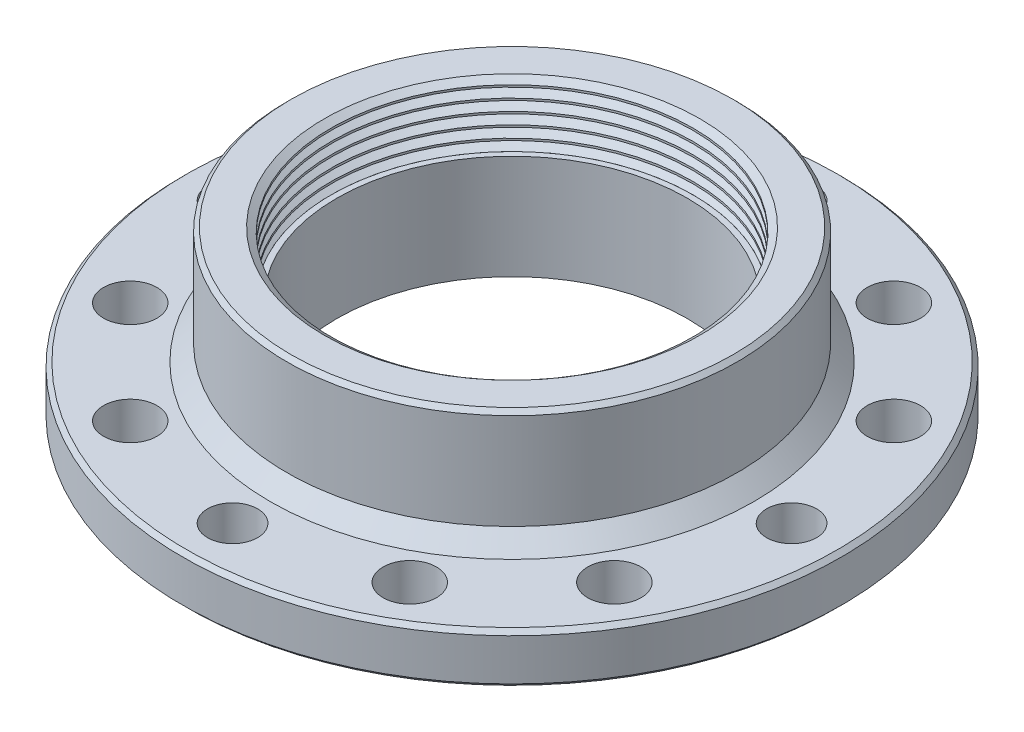
ISO-10303-21;
HEADER;
FILE_DESCRIPTION(('STEP AP214'),'2;1');
FILE_NAME('part.step','',(''),(''),'','','');
FILE_SCHEMA(('AUTOMOTIVE_DESIGN { 1 0 10303 214 1 1 1 1 }'));
ENDSEC;
DATA;
#1=APPLICATION_CONTEXT('core data for automotive mechanical design processes');
#2=APPLICATION_PROTOCOL_DEFINITION('international standard','automotive_design',2000,#1);
#3=PRODUCT_CONTEXT('',#1,'mechanical');
#4=PRODUCT('Part','Part','',(#3));
#5=PRODUCT_RELATED_PRODUCT_CATEGORY('part','',(#4));
#6=PRODUCT_DEFINITION_FORMATION('','',#4);
#7=PRODUCT_DEFINITION_CONTEXT('part definition',#1,'design');
#8=PRODUCT_DEFINITION('design','',#6,#7);
#9=PRODUCT_DEFINITION_SHAPE('','',#8);
#10=(LENGTH_UNIT() NAMED_UNIT(*) SI_UNIT(.MILLI.,.METRE.));
#11=(NAMED_UNIT(*) PLANE_ANGLE_UNIT() SI_UNIT($,.RADIAN.));
#12=(NAMED_UNIT(*) SI_UNIT($,.STERADIAN.) SOLID_ANGLE_UNIT());
#13=UNCERTAINTY_MEASURE_WITH_UNIT(LENGTH_MEASURE(1.E-05),#10,'distance_accuracy_value','');
#14=(GEOMETRIC_REPRESENTATION_CONTEXT(3) GLOBAL_UNCERTAINTY_ASSIGNED_CONTEXT((#13)) GLOBAL_UNIT_ASSIGNED_CONTEXT((#10,
#11,#12)) REPRESENTATION_CONTEXT('',''));
#15=CARTESIAN_POINT('',(0.,0.,0.));
#16=DIRECTION('',(0.,0.,1.));
#17=DIRECTION('',(1.,0.,0.));
#18=AXIS2_PLACEMENT_3D('',#15,#16,#17);
#19=CARTESIAN_POINT('',(0.,12.5,0.));
#20=DIRECTION('',(0.,1.,0.));
#21=DIRECTION('',(0.,0.,1.00000000000001));
#22=AXIS2_PLACEMENT_3D('',#19,#20,#21);
#23=CYLINDRICAL_SURFACE('',#22,21.688);
#24=CARTESIAN_POINT('',(0.,12.5,0.));
#25=DIRECTION('',(0.,1.,0.));
#26=DIRECTION('',(0.,0.,1.00000000000001));
#27=AXIS2_PLACEMENT_3D('',#24,#25,#26);
#28=CIRCLE('',#27,21.688);
#29=CARTESIAN_POINT('',(0.,12.5,21.6880000000001));
#30=VERTEX_POINT('',#29);
#31=EDGE_CURVE('E70',#30,#30,#28,.T.);
#32=ORIENTED_EDGE('',*,*,#31,.F.);
#33=EDGE_LOOP('',(#32));
#34=FACE_BOUND('',#33,.T.);
#35=CARTESIAN_POINT('',(0.,12.5014314789737,0.));
#36=DIRECTION('',(0.,-1.,0.));
#37=DIRECTION('',(0.,0.,-1.00000000000001));
#38=AXIS2_PLACEMENT_3D('',#35,#36,#37);
#39=CIRCLE('',#38,21.688);
#40=CARTESIAN_POINT('',(0.,12.5014314789737,-21.6880000000001));
#41=VERTEX_POINT('',#40);
#42=EDGE_CURVE('E328',#41,#41,#39,.T.);
#43=ORIENTED_EDGE('',*,*,#42,.F.);
#44=EDGE_LOOP('',(#43));
#45=FACE_BOUND('',#44,.T.);
#46=ADVANCED_FACE('F38',(#34,#45),#23,.F.);
#47=CARTESIAN_POINT('',(0.,13.8874314789737,0.));
#48=DIRECTION('',(0.,-1.,0.));
#49=DIRECTION('',(0.,0.,-1.00000000000001));
#50=AXIS2_PLACEMENT_3D('',#47,#48,#49);
#51=CIRCLE('',#50,21.688);
#52=CARTESIAN_POINT('',(0.,13.8874314789737,-21.6880000000001));
#53=VERTEX_POINT('',#52);
#54=EDGE_CURVE('E340',#53,#53,#51,.T.);
#55=ORIENTED_EDGE('',*,*,#54,.F.);
#56=EDGE_LOOP('',(#55));
#57=FACE_BOUND('',#56,.T.);
#58=CARTESIAN_POINT('',(0.,13.6385685210263,0.));
#59=DIRECTION('',(0.,-1.,0.));
#60=DIRECTION('',(0.,0.,-1.00000000000001));
#61=AXIS2_PLACEMENT_3D('',#58,#59,#60);
#62=CIRCLE('',#61,21.688);
#63=CARTESIAN_POINT('',(0.,13.6385685210263,-21.6880000000001));
#64=VERTEX_POINT('',#63);
#65=EDGE_CURVE('E326',#64,#64,#62,.T.);
#66=ORIENTED_EDGE('',*,*,#65,.T.);
#67=EDGE_LOOP('',(#66));
#68=FACE_BOUND('',#67,.T.);
#69=ADVANCED_FACE('F223',(#57,#68),#23,.F.);
#70=CARTESIAN_POINT('',(0.,15.2734314789737,0.));
#71=DIRECTION('',(0.,-1.,0.));
#72=DIRECTION('',(0.,0.,-1.00000000000001));
#73=AXIS2_PLACEMENT_3D('',#70,#71,#72);
#74=CIRCLE('',#73,21.688);
#75=CARTESIAN_POINT('',(0.,15.2734314789737,-21.6880000000001));
#76=VERTEX_POINT('',#75);
#77=EDGE_CURVE('E350',#76,#76,#74,.T.);
#78=ORIENTED_EDGE('',*,*,#77,.F.);
#79=EDGE_LOOP('',(#78));
#80=FACE_BOUND('',#79,.T.);
#81=CARTESIAN_POINT('',(0.,15.0245685210263,0.));
#82=DIRECTION('',(0.,-1.,0.));
#83=DIRECTION('',(0.,0.,-1.00000000000001));
#84=AXIS2_PLACEMENT_3D('',#81,#82,#83);
#85=CIRCLE('',#84,21.688);
#86=CARTESIAN_POINT('',(0.,15.0245685210263,-21.6880000000001));
#87=VERTEX_POINT('',#86);
#88=EDGE_CURVE('E337',#87,#87,#85,.T.);
#89=ORIENTED_EDGE('',*,*,#88,.T.);
#90=EDGE_LOOP('',(#89));
#91=FACE_BOUND('',#90,.T.);
#92=ADVANCED_FACE('F230',(#80,#91),#23,.F.);
#93=CARTESIAN_POINT('',(0.,16.6594314789737,0.));
#94=DIRECTION('',(0.,-1.,0.));
#95=DIRECTION('',(0.,0.,-1.00000000000001));
#96=AXIS2_PLACEMENT_3D('',#93,#94,#95);
#97=CIRCLE('',#96,21.688);
#98=CARTESIAN_POINT('',(0.,16.6594314789737,-21.6880000000001));
#99=VERTEX_POINT('',#98);
#100=EDGE_CURVE('E259',#99,#99,#97,.T.);
#101=ORIENTED_EDGE('',*,*,#100,.F.);
#102=EDGE_LOOP('',(#101));
#103=FACE_BOUND('',#102,.T.);
#104=CARTESIAN_POINT('',(0.,16.4105685210263,0.));
#105=DIRECTION('',(0.,-1.,0.));
#106=DIRECTION('',(0.,0.,-1.00000000000001));
#107=AXIS2_PLACEMENT_3D('',#104,#105,#106);
#108=CIRCLE('',#107,21.688);
#109=CARTESIAN_POINT('',(0.,16.4105685210263,-21.6880000000001));
#110=VERTEX_POINT('',#109);
#111=EDGE_CURVE('E347',#110,#110,#108,.T.);
#112=ORIENTED_EDGE('',*,*,#111,.T.);
#113=EDGE_LOOP('',(#112));
#114=FACE_BOUND('',#113,.T.);
#115=ADVANCED_FACE('F244',(#103,#114),#23,.F.);
#116=CARTESIAN_POINT('',(0.,18.0454314789737,0.));
#117=DIRECTION('',(0.,-1.,0.));
#118=DIRECTION('',(0.,0.,-1.00000000000001));
#119=AXIS2_PLACEMENT_3D('',#116,#117,#118);
#120=CIRCLE('',#119,21.688);
#121=CARTESIAN_POINT('',(0.,18.0454314789737,-21.6880000000001));
#122=VERTEX_POINT('',#121);
#123=EDGE_CURVE('E252',#122,#122,#120,.T.);
#124=ORIENTED_EDGE('',*,*,#123,.F.);
#125=EDGE_LOOP('',(#124));
#126=FACE_BOUND('',#125,.T.);
#127=CARTESIAN_POINT('',(0.,17.7965685210263,0.));
#128=DIRECTION('',(0.,-1.,0.));
#129=DIRECTION('',(0.,0.,-1.00000000000001));
#130=AXIS2_PLACEMENT_3D('',#127,#128,#129);
#131=CIRCLE('',#130,21.688);
#132=CARTESIAN_POINT('',(0.,17.7965685210263,-21.6880000000001));
#133=VERTEX_POINT('',#132);
#134=EDGE_CURVE('E358',#133,#133,#131,.T.);
#135=ORIENTED_EDGE('',*,*,#134,.T.);
#136=EDGE_LOOP('',(#135));
#137=FACE_BOUND('',#136,.T.);
#138=ADVANCED_FACE('F237',(#126,#137),#23,.F.);
#139=CARTESIAN_POINT('',(0.,19.4314314789737,0.));
#140=DIRECTION('',(0.,-1.,0.));
#141=DIRECTION('',(0.,0.,-1.00000000000001));
#142=AXIS2_PLACEMENT_3D('',#139,#140,#141);
#143=CIRCLE('',#142,21.688);
#144=CARTESIAN_POINT('',(0.,19.4314314789737,-21.6880000000001));
#145=VERTEX_POINT('',#144);
#146=EDGE_CURVE('E77',#145,#145,#143,.T.);
#147=ORIENTED_EDGE('',*,*,#146,.F.);
#148=EDGE_LOOP('',(#147));
#149=FACE_BOUND('',#148,.T.);
#150=CARTESIAN_POINT('',(0.,19.1825685210263,0.));
#151=DIRECTION('',(0.,-1.,0.));
#152=DIRECTION('',(0.,0.,-1.00000000000001));
#153=AXIS2_PLACEMENT_3D('',#150,#151,#152);
#154=CIRCLE('',#153,21.688);
#155=CARTESIAN_POINT('',(0.,19.1825685210263,-21.6880000000001));
#156=VERTEX_POINT('',#155);
#157=EDGE_CURVE('E250',#156,#156,#154,.T.);
#158=ORIENTED_EDGE('',*,*,#157,.T.);
#159=EDGE_LOOP('',(#158));
#160=FACE_BOUND('',#159,.T.);
#161=ADVANCED_FACE('F226',(#149,#160),#23,.F.);
#162=CARTESIAN_POINT('',(-25.9763261820386,20.,0.));
#163=DIRECTION('',(0.,-1.,0.));
#164=DIRECTION('',(0.,0.,-1.00000000000001));
#165=AXIS2_PLACEMENT_3D('',#162,#163,#164);
#166=PLANE('',#165);
#167=CARTESIAN_POINT('',(0.,20.,0.));
#168=DIRECTION('',(0.,-1.,0.));
#169=DIRECTION('',(0.,0.,-1.00000000000001));
#170=AXIS2_PLACEMENT_3D('',#167,#168,#169);
#171=CIRCLE('',#170,26.5);
#172=CARTESIAN_POINT('',(0.,20.,-26.5000000000001));
#173=VERTEX_POINT('',#172);
#174=EDGE_CURVE('E10',#173,#173,#171,.F.);
#175=ORIENTED_EDGE('',*,*,#174,.T.);
#176=EDGE_LOOP('',(#175));
#177=FACE_BOUND('',#176,.T.);
#178=CARTESIAN_POINT('',(0.,20.,0.));
#179=DIRECTION('',(0.,-1.,0.));
#180=DIRECTION('',(0.,0.,-1.00000000000001));
#181=AXIS2_PLACEMENT_3D('',#178,#179,#180);
#182=CIRCLE('',#181,22.5);
#183=CARTESIAN_POINT('',(0.,20.,-22.5000000000001));
#184=VERTEX_POINT('',#183);
#185=EDGE_CURVE('E83',#184,#184,#182,.T.);
#186=ORIENTED_EDGE('',*,*,#185,.T.);
#187=EDGE_LOOP('',(#186));
#188=FACE_BOUND('',#187,.T.);
#189=ADVANCED_FACE('F236',(#177,#188),#166,.F.);
#190=CARTESIAN_POINT('',(0.,0.,0.));
#191=DIRECTION('',(0.,-1.,0.));
#192=DIRECTION('',(0.,0.,-1.00000000000001));
#193=AXIS2_PLACEMENT_3D('',#190,#191,#192);
#194=CYLINDRICAL_SURFACE('',#193,21.);
#195=CARTESIAN_POINT('',(0.,0.,0.));
#196=DIRECTION('',(0.,-1.,0.));
#197=DIRECTION('',(0.,0.,-1.00000000000001));
#198=AXIS2_PLACEMENT_3D('',#195,#196,#197);
#199=CIRCLE('',#198,21.);
#200=CARTESIAN_POINT('',(0.,0.,-21.0000000000001));
#201=VERTEX_POINT('',#200);
#202=EDGE_CURVE('E169',#201,#201,#199,.T.);
#203=ORIENTED_EDGE('',*,*,#202,.T.);
#204=EDGE_LOOP('',(#203));
#205=FACE_BOUND('',#204,.T.);
#206=CARTESIAN_POINT('',(0.,12.5,0.));
#207=DIRECTION('',(0.,1.,0.));
#208=DIRECTION('',(0.,0.,1.00000000000001));
#209=AXIS2_PLACEMENT_3D('',#206,#207,#208);
#210=CIRCLE('',#209,21.);
#211=CARTESIAN_POINT('',(0.,12.5,21.0000000000001));
#212=VERTEX_POINT('',#211);
#213=EDGE_CURVE('E42',#212,#212,#210,.F.);
#214=ORIENTED_EDGE('',*,*,#213,.F.);
#215=EDGE_LOOP('',(#214));
#216=FACE_BOUND('',#215,.T.);
#217=ADVANCED_FACE('F218',(#205,#216),#194,.F.);
#218=CARTESIAN_POINT('',(-25.9763261820386,6.,0.));
#219=DIRECTION('',(0.,-1.,0.));
#220=DIRECTION('',(0.,0.,-1.00000000000001));
#221=AXIS2_PLACEMENT_3D('',#218,#219,#220);
#222=PLANE('',#221);
#223=CARTESIAN_POINT('',(0.,6.,0.));
#224=DIRECTION('',(0.,-1.,0.));
#225=DIRECTION('',(0.,0.,-1.00000000000001));
#226=AXIS2_PLACEMENT_3D('',#223,#224,#225);
#227=CIRCLE('',#226,29.);
#228=CARTESIAN_POINT('',(0.,6.,-29.0000000000002));
#229=VERTEX_POINT('',#228);
#230=EDGE_CURVE('E173',#229,#229,#227,.T.);
#231=ORIENTED_EDGE('',*,*,#230,.T.);
#232=EDGE_LOOP('',(#231));
#233=FACE_BOUND('',#232,.T.);
#234=CARTESIAN_POINT('',(0.,6.,0.));
#235=DIRECTION('',(0.,-1.,0.));
#236=DIRECTION('',(0.,0.,-1.00000000000001));
#237=AXIS2_PLACEMENT_3D('',#234,#235,#236);
#238=CIRCLE('',#237,39.);
#239=CARTESIAN_POINT('',(0.,6.,-39.0000000000002));
#240=VERTEX_POINT('',#239);
#241=EDGE_CURVE('E56',#240,#240,#238,.F.);
#242=ORIENTED_EDGE('',*,*,#241,.T.);
#243=EDGE_LOOP('',(#242));
#244=FACE_BOUND('',#243,.T.);
#245=CARTESIAN_POINT('',(16.7500000000001,6.,29.011851026779));
#246=DIRECTION('',(0.,1.,0.));
#247=DIRECTION('',(0.,0.,1.00000000000001));
#248=AXIS2_PLACEMENT_3D('',#245,#246,#247);
#249=CIRCLE('',#248,3.19999999999999);
#250=CARTESIAN_POINT('',(16.7500000000001,6.,32.211851026779));
#251=VERTEX_POINT('',#250);
#252=EDGE_CURVE('E161',#251,#251,#249,.T.);
#253=ORIENTED_EDGE('',*,*,#252,.F.);
#254=EDGE_LOOP('',(#253));
#255=FACE_BOUND('',#254,.T.);
#256=CARTESIAN_POINT('',(29.0118510267789,6.,-16.7500000000001));
#257=DIRECTION('',(0.,1.,0.));
#258=DIRECTION('',(0.,0.,1.00000000000001));
#259=AXIS2_PLACEMENT_3D('',#256,#257,#258);
#260=CIRCLE('',#259,3.19999999999999);
#261=CARTESIAN_POINT('',(29.0118510267789,6.,-13.5500000000001));
#262=VERTEX_POINT('',#261);
#263=EDGE_CURVE('E154',#262,#262,#260,.T.);
#264=ORIENTED_EDGE('',*,*,#263,.F.);
#265=EDGE_LOOP('',(#264));
#266=FACE_BOUND('',#265,.T.);
#267=CARTESIAN_POINT('',(-16.7500000000001,6.,-29.0118510267788));
#268=DIRECTION('',(0.,1.,0.));
#269=DIRECTION('',(0.,0.,1.00000000000001));
#270=AXIS2_PLACEMENT_3D('',#267,#268,#269);
#271=CIRCLE('',#270,3.19999999999999);
#272=CARTESIAN_POINT('',(-16.7500000000001,6.,-25.8118510267788));
#273=VERTEX_POINT('',#272);
#274=EDGE_CURVE('E146',#273,#273,#271,.T.);
#275=ORIENTED_EDGE('',*,*,#274,.F.);
#276=EDGE_LOOP('',(#275));
#277=FACE_BOUND('',#276,.T.);
#278=CARTESIAN_POINT('',(-29.0118510267789,6.,16.7500000000003));
#279=DIRECTION('',(0.,1.,0.));
#280=DIRECTION('',(0.,0.,1.00000000000001));
#281=AXIS2_PLACEMENT_3D('',#278,#279,#280);
#282=CIRCLE('',#281,3.19999999999999);
#283=CARTESIAN_POINT('',(-29.0118510267789,6.,19.9500000000003));
#284=VERTEX_POINT('',#283);
#285=EDGE_CURVE('E139',#284,#284,#282,.T.);
#286=ORIENTED_EDGE('',*,*,#285,.F.);
#287=EDGE_LOOP('',(#286));
#288=FACE_BOUND('',#287,.T.);
#289=CARTESIAN_POINT('',(29.0118510267789,6.,16.7500000000002));
#290=DIRECTION('',(0.,1.,0.));
#291=DIRECTION('',(0.,0.,1.00000000000001));
#292=AXIS2_PLACEMENT_3D('',#289,#290,#291);
#293=CIRCLE('',#292,3.19999999999999);
#294=CARTESIAN_POINT('',(29.0118510267789,6.,19.9500000000002));
#295=VERTEX_POINT('',#294);
#296=EDGE_CURVE('E131',#295,#295,#293,.T.);
#297=ORIENTED_EDGE('',*,*,#296,.F.);
#298=EDGE_LOOP('',(#297));
#299=FACE_BOUND('',#298,.T.);
#300=CARTESIAN_POINT('',(16.7500000000001,6.,-29.0118510267788));
#301=DIRECTION('',(0.,1.,0.));
#302=DIRECTION('',(0.,0.,1.00000000000001));
#303=AXIS2_PLACEMENT_3D('',#300,#301,#302);
#304=CIRCLE('',#303,3.19999999999999);
#305=CARTESIAN_POINT('',(16.7500000000001,6.,-25.8118510267788));
#306=VERTEX_POINT('',#305);
#307=EDGE_CURVE('E124',#306,#306,#304,.T.);
#308=ORIENTED_EDGE('',*,*,#307,.F.);
#309=EDGE_LOOP('',(#308));
#310=FACE_BOUND('',#309,.T.);
#311=CARTESIAN_POINT('',(-29.0118510267789,6.,-16.75));
#312=DIRECTION('',(0.,1.,0.));
#313=DIRECTION('',(0.,0.,1.00000000000001));
#314=AXIS2_PLACEMENT_3D('',#311,#312,#313);
#315=CIRCLE('',#314,3.19999999999999);
#316=CARTESIAN_POINT('',(-29.0118510267789,6.,-13.55));
#317=VERTEX_POINT('',#316);
#318=EDGE_CURVE('E117',#317,#317,#315,.T.);
#319=ORIENTED_EDGE('',*,*,#318,.F.);
#320=EDGE_LOOP('',(#319));
#321=FACE_BOUND('',#320,.T.);
#322=CARTESIAN_POINT('',(-16.7500000000001,6.,29.0118510267789));
#323=DIRECTION('',(0.,1.,0.));
#324=DIRECTION('',(0.,0.,1.00000000000001));
#325=AXIS2_PLACEMENT_3D('',#322,#323,#324);
#326=CIRCLE('',#325,3.19999999999999);
#327=CARTESIAN_POINT('',(-16.7500000000001,6.,32.2118510267789));
#328=VERTEX_POINT('',#327);
#329=EDGE_CURVE('E108',#328,#328,#326,.T.);
#330=ORIENTED_EDGE('',*,*,#329,.F.);
#331=EDGE_LOOP('',(#330));
#332=FACE_BOUND('',#331,.T.);
#333=CARTESIAN_POINT('',(-33.5000000000002,6.,0.));
#334=DIRECTION('',(0.,1.,0.));
#335=DIRECTION('',(0.,0.,1.00000000000001));
#336=AXIS2_PLACEMENT_3D('',#333,#334,#335);
#337=CIRCLE('',#336,3.);
#338=CARTESIAN_POINT('',(-33.5000000000002,6.,3.00000000000002));
#339=VERTEX_POINT('',#338);
#340=EDGE_CURVE('E101',#339,#339,#337,.T.);
#341=ORIENTED_EDGE('',*,*,#340,.F.);
#342=EDGE_LOOP('',(#341));
#343=FACE_BOUND('',#342,.T.);
#344=CARTESIAN_POINT('',(0.,6.,-33.5000000000001));
#345=DIRECTION('',(0.,1.,0.));
#346=DIRECTION('',(0.,0.,1.00000000000001));
#347=AXIS2_PLACEMENT_3D('',#344,#345,#346);
#348=CIRCLE('',#347,3.);
#349=CARTESIAN_POINT('',(0.,6.,-30.5000000000001));
#350=VERTEX_POINT('',#349);
#351=EDGE_CURVE('E94',#350,#350,#348,.T.);
#352=ORIENTED_EDGE('',*,*,#351,.F.);
#353=EDGE_LOOP('',(#352));
#354=FACE_BOUND('',#353,.T.);
#355=CARTESIAN_POINT('',(33.5000000000002,6.,0.));
#356=DIRECTION('',(0.,1.,0.));
#357=DIRECTION('',(0.,0.,1.00000000000001));
#358=AXIS2_PLACEMENT_3D('',#355,#356,#357);
#359=CIRCLE('',#358,3.);
#360=CARTESIAN_POINT('',(33.5000000000002,6.,3.00000000000003));
#361=VERTEX_POINT('',#360);
#362=EDGE_CURVE('E89',#361,#361,#359,.T.);
#363=ORIENTED_EDGE('',*,*,#362,.F.);
#364=EDGE_LOOP('',(#363));
#365=FACE_BOUND('',#364,.T.);
#366=CARTESIAN_POINT('',(0.,6.,33.5000000000003));
#367=DIRECTION('',(0.,1.,0.));
#368=DIRECTION('',(0.,0.,1.00000000000001));
#369=AXIS2_PLACEMENT_3D('',#366,#367,#368);
#370=CIRCLE('',#369,3.);
#371=CARTESIAN_POINT('',(0.,6.,36.5000000000003));
#372=VERTEX_POINT('',#371);
#373=EDGE_CURVE('E61',#372,#372,#370,.T.);
#374=ORIENTED_EDGE('',*,*,#373,.F.);
#375=EDGE_LOOP('',(#374));
#376=FACE_BOUND('',#375,.T.);
#377=CARTESIAN_POINT('',(-23.6880771697496,6.,-23.6880771697494));
#378=DIRECTION('',(0.,-1.,0.));
#379=DIRECTION('',(0.,0.,-1.00000000000001));
#380=AXIS2_PLACEMENT_3D('',#377,#378,#379);
#381=CIRCLE('',#380,0.500000000000001);
#382=CARTESIAN_POINT('',(-23.6880771697496,6.,-24.1880771697494));
#383=VERTEX_POINT('',#382);
#384=EDGE_CURVE('E59',#383,#383,#381,.F.);
#385=ORIENTED_EDGE('',*,*,#384,.F.);
#386=EDGE_LOOP('',(#385));
#387=FACE_BOUND('',#386,.T.);
#388=ADVANCED_FACE('F197',(#233,#244,#255,#266,#277,#288,#299,#310,#321,#332,#343,#354,#365,
#376,#387),#222,.F.);
#389=CARTESIAN_POINT('',(0.,0.,0.));
#390=DIRECTION('',(0.,-1.,0.));
#391=DIRECTION('',(0.,0.,-1.00000000000001));
#392=AXIS2_PLACEMENT_3D('',#389,#390,#391);
#393=CYLINDRICAL_SURFACE('',#392,39.5);
#394=CARTESIAN_POINT('',(0.,0.49999999999998,0.));
#395=DIRECTION('',(0.,-1.,0.));
#396=DIRECTION('',(0.,0.,-1.00000000000001));
#397=AXIS2_PLACEMENT_3D('',#394,#395,#396);
#398=CIRCLE('',#397,39.5);
#399=CARTESIAN_POINT('',(0.,0.49999999999998,-39.5000000000002));
#400=VERTEX_POINT('',#399);
#401=EDGE_CURVE('E189',#400,#400,#398,.F.);
#402=ORIENTED_EDGE('',*,*,#401,.T.);
#403=EDGE_LOOP('',(#402));
#404=FACE_BOUND('',#403,.T.);
#405=CARTESIAN_POINT('',(0.,5.49999999999998,0.));
#406=DIRECTION('',(0.,-1.,0.));
#407=DIRECTION('',(0.,0.,-1.00000000000001));
#408=AXIS2_PLACEMENT_3D('',#405,#406,#407);
#409=CIRCLE('',#408,39.5);
#410=CARTESIAN_POINT('',(0.,5.49999999999998,-39.5000000000002));
#411=VERTEX_POINT('',#410);
#412=EDGE_CURVE('E185',#411,#411,#409,.T.);
#413=ORIENTED_EDGE('',*,*,#412,.T.);
#414=EDGE_LOOP('',(#413));
#415=FACE_BOUND('',#414,.T.);
#416=ADVANCED_FACE('F206',(#404,#415),#393,.T.);
#417=CARTESIAN_POINT('',(-25.9763261820386,0.,0.));
#418=DIRECTION('',(0.,-1.,0.));
#419=DIRECTION('',(0.,0.,-1.00000000000001));
#420=AXIS2_PLACEMENT_3D('',#417,#418,#419);
#421=PLANE('',#420);
#422=CARTESIAN_POINT('',(0.,0.,33.5000000000003));
#423=DIRECTION('',(0.,1.,0.));
#424=DIRECTION('',(0.,0.,1.00000000000001));
#425=AXIS2_PLACEMENT_3D('',#422,#423,#424);
#426=CIRCLE('',#425,3.);
#427=CARTESIAN_POINT('',(0.,0.,36.5000000000003));
#428=VERTEX_POINT('',#427);
#429=EDGE_CURVE('E66',#428,#428,#426,.T.);
#430=ORIENTED_EDGE('',*,*,#429,.T.);
#431=EDGE_LOOP('',(#430));
#432=FACE_BOUND('',#431,.T.);
#433=CARTESIAN_POINT('',(33.5000000000002,0.,0.));
#434=DIRECTION('',(0.,1.,0.));
#435=DIRECTION('',(0.,0.,1.00000000000001));
#436=AXIS2_PLACEMENT_3D('',#433,#434,#435);
#437=CIRCLE('',#436,3.);
#438=CARTESIAN_POINT('',(33.5000000000002,0.,3.00000000000003));
#439=VERTEX_POINT('',#438);
#440=EDGE_CURVE('E91',#439,#439,#437,.T.);
#441=ORIENTED_EDGE('',*,*,#440,.T.);
#442=EDGE_LOOP('',(#441));
#443=FACE_BOUND('',#442,.T.);
#444=CARTESIAN_POINT('',(0.,0.,-33.5000000000001));
#445=DIRECTION('',(0.,1.,0.));
#446=DIRECTION('',(0.,0.,1.00000000000001));
#447=AXIS2_PLACEMENT_3D('',#444,#445,#446);
#448=CIRCLE('',#447,3.);
#449=CARTESIAN_POINT('',(0.,0.,-30.5000000000001));
#450=VERTEX_POINT('',#449);
#451=EDGE_CURVE('E98',#450,#450,#448,.T.);
#452=ORIENTED_EDGE('',*,*,#451,.T.);
#453=EDGE_LOOP('',(#452));
#454=FACE_BOUND('',#453,.T.);
#455=CARTESIAN_POINT('',(-33.5000000000002,0.,0.));
#456=DIRECTION('',(0.,1.,0.));
#457=DIRECTION('',(0.,0.,1.00000000000001));
#458=AXIS2_PLACEMENT_3D('',#455,#456,#457);
#459=CIRCLE('',#458,3.);
#460=CARTESIAN_POINT('',(-33.5000000000002,0.,3.00000000000002));
#461=VERTEX_POINT('',#460);
#462=EDGE_CURVE('E105',#461,#461,#459,.T.);
#463=ORIENTED_EDGE('',*,*,#462,.T.);
#464=EDGE_LOOP('',(#463));
#465=FACE_BOUND('',#464,.T.);
#466=CARTESIAN_POINT('',(-16.7500000000001,0.,29.0118510267789));
#467=DIRECTION('',(0.,1.,0.));
#468=DIRECTION('',(0.,0.,1.00000000000001));
#469=AXIS2_PLACEMENT_3D('',#466,#467,#468);
#470=CIRCLE('',#469,3.2);
#471=CARTESIAN_POINT('',(-16.7500000000001,0.,32.2118510267789));
#472=VERTEX_POINT('',#471);
#473=EDGE_CURVE('E114',#472,#472,#470,.T.);
#474=ORIENTED_EDGE('',*,*,#473,.T.);
#475=EDGE_LOOP('',(#474));
#476=FACE_BOUND('',#475,.T.);
#477=CARTESIAN_POINT('',(-29.0118510267789,0.,-16.75));
#478=DIRECTION('',(0.,1.,0.));
#479=DIRECTION('',(0.,0.,1.00000000000001));
#480=AXIS2_PLACEMENT_3D('',#477,#478,#479);
#481=CIRCLE('',#480,3.2);
#482=CARTESIAN_POINT('',(-29.0118510267789,0.,-13.55));
#483=VERTEX_POINT('',#482);
#484=EDGE_CURVE('E121',#483,#483,#481,.T.);
#485=ORIENTED_EDGE('',*,*,#484,.T.);
#486=EDGE_LOOP('',(#485));
#487=FACE_BOUND('',#486,.T.);
#488=CARTESIAN_POINT('',(16.7500000000001,0.,-29.0118510267788));
#489=DIRECTION('',(0.,1.,0.));
#490=DIRECTION('',(0.,0.,1.00000000000001));
#491=AXIS2_PLACEMENT_3D('',#488,#489,#490);
#492=CIRCLE('',#491,3.2);
#493=CARTESIAN_POINT('',(16.7500000000001,0.,-25.8118510267788));
#494=VERTEX_POINT('',#493);
#495=EDGE_CURVE('E128',#494,#494,#492,.T.);
#496=ORIENTED_EDGE('',*,*,#495,.T.);
#497=EDGE_LOOP('',(#496));
#498=FACE_BOUND('',#497,.T.);
#499=CARTESIAN_POINT('',(29.0118510267789,0.,16.7500000000002));
#500=DIRECTION('',(0.,1.,0.));
#501=DIRECTION('',(0.,0.,1.00000000000001));
#502=AXIS2_PLACEMENT_3D('',#499,#500,#501);
#503=CIRCLE('',#502,3.2);
#504=CARTESIAN_POINT('',(29.0118510267789,0.,19.9500000000002));
#505=VERTEX_POINT('',#504);
#506=EDGE_CURVE('E135',#505,#505,#503,.T.);
#507=ORIENTED_EDGE('',*,*,#506,.T.);
#508=EDGE_LOOP('',(#507));
#509=FACE_BOUND('',#508,.T.);
#510=CARTESIAN_POINT('',(-29.0118510267789,0.,16.7500000000003));
#511=DIRECTION('',(0.,1.,0.));
#512=DIRECTION('',(0.,0.,1.00000000000001));
#513=AXIS2_PLACEMENT_3D('',#510,#511,#512);
#514=CIRCLE('',#513,3.2);
#515=CARTESIAN_POINT('',(-29.0118510267789,0.,19.9500000000003));
#516=VERTEX_POINT('',#515);
#517=EDGE_CURVE('E142',#516,#516,#514,.T.);
#518=ORIENTED_EDGE('',*,*,#517,.T.);
#519=EDGE_LOOP('',(#518));
#520=FACE_BOUND('',#519,.T.);
#521=CARTESIAN_POINT('',(-16.7500000000001,0.,-29.0118510267788));
#522=DIRECTION('',(0.,1.,0.));
#523=DIRECTION('',(0.,0.,1.00000000000001));
#524=AXIS2_PLACEMENT_3D('',#521,#522,#523);
#525=CIRCLE('',#524,3.2);
#526=CARTESIAN_POINT('',(-16.7500000000001,0.,-25.8118510267788));
#527=VERTEX_POINT('',#526);
#528=EDGE_CURVE('E150',#527,#527,#525,.T.);
#529=ORIENTED_EDGE('',*,*,#528,.T.);
#530=EDGE_LOOP('',(#529));
#531=FACE_BOUND('',#530,.T.);
#532=CARTESIAN_POINT('',(29.0118510267789,0.,-16.7500000000001));
#533=DIRECTION('',(0.,1.,0.));
#534=DIRECTION('',(0.,0.,1.00000000000001));
#535=AXIS2_PLACEMENT_3D('',#532,#533,#534);
#536=CIRCLE('',#535,3.2);
#537=CARTESIAN_POINT('',(29.0118510267789,0.,-13.5500000000001));
#538=VERTEX_POINT('',#537);
#539=EDGE_CURVE('E158',#538,#538,#536,.T.);
#540=ORIENTED_EDGE('',*,*,#539,.T.);
#541=EDGE_LOOP('',(#540));
#542=FACE_BOUND('',#541,.T.);
#543=CARTESIAN_POINT('',(16.7500000000001,0.,29.011851026779));
#544=DIRECTION('',(0.,1.,0.));
#545=DIRECTION('',(0.,0.,1.00000000000001));
#546=AXIS2_PLACEMENT_3D('',#543,#544,#545);
#547=CIRCLE('',#546,3.2);
#548=CARTESIAN_POINT('',(16.7500000000001,0.,32.211851026779));
#549=VERTEX_POINT('',#548);
#550=EDGE_CURVE('E165',#549,#549,#547,.T.);
#551=ORIENTED_EDGE('',*,*,#550,.T.);
#552=EDGE_LOOP('',(#551));
#553=FACE_BOUND('',#552,.T.);
#554=CARTESIAN_POINT('',(0.,0.,0.));
#555=DIRECTION('',(0.,-1.,0.));
#556=DIRECTION('',(0.,0.,-1.00000000000001));
#557=AXIS2_PLACEMENT_3D('',#554,#555,#556);
#558=CIRCLE('',#557,39.);
#559=CARTESIAN_POINT('',(0.,0.,-39.0000000000003));
#560=VERTEX_POINT('',#559);
#561=EDGE_CURVE('E181',#560,#560,#558,.T.);
#562=ORIENTED_EDGE('',*,*,#561,.T.);
#563=EDGE_LOOP('',(#562));
#564=FACE_BOUND('',#563,.T.);
#565=ORIENTED_EDGE('',*,*,#202,.F.);
#566=EDGE_LOOP('',(#565));
#567=FACE_BOUND('',#566,.T.);
#568=ADVANCED_FACE('F208',(#432,#443,#454,#465,#476,#487,#498,#509,#520,#531,#542,#553,#564,
#567),#421,.T.);
#569=CARTESIAN_POINT('',(0.,0.,0.));
#570=DIRECTION('',(0.,-1.,0.));
#571=DIRECTION('',(0.,0.,-1.00000000000001));
#572=AXIS2_PLACEMENT_3D('',#569,#570,#571);
#573=CYLINDRICAL_SURFACE('',#572,27.);
#574=CARTESIAN_POINT('',(0.,19.5,0.));
#575=DIRECTION('',(0.,-1.,0.));
#576=DIRECTION('',(0.,0.,-1.00000000000001));
#577=AXIS2_PLACEMENT_3D('',#574,#575,#576);
#578=CIRCLE('',#577,27.);
#579=CARTESIAN_POINT('',(0.,19.5,-27.0000000000002));
#580=VERTEX_POINT('',#579);
#581=EDGE_CURVE('E47',#580,#580,#578,.T.);
#582=ORIENTED_EDGE('',*,*,#581,.T.);
#583=EDGE_LOOP('',(#582));
#584=FACE_BOUND('',#583,.T.);
#585=CARTESIAN_POINT('',(0.,7.99999999999999,0.));
#586=DIRECTION('',(0.,-1.,0.));
#587=DIRECTION('',(0.,0.,-1.00000000000001));
#588=AXIS2_PLACEMENT_3D('',#585,#586,#587);
#589=CIRCLE('',#588,27.);
#590=CARTESIAN_POINT('',(0.,7.99999999999999,-27.0000000000002));
#591=VERTEX_POINT('',#590);
#592=EDGE_CURVE('E177',#591,#591,#589,.F.);
#593=ORIENTED_EDGE('',*,*,#592,.T.);
#594=EDGE_LOOP('',(#593));
#595=FACE_BOUND('',#594,.T.);
#596=ADVANCED_FACE('F215',(#584,#595),#573,.T.);
#597=CARTESIAN_POINT('',(0.,6.,0.));
#598=DIRECTION('',(0.,-1.,0.));
#599=DIRECTION('',(0.,0.,-1.00000000000001));
#600=AXIS2_PLACEMENT_3D('',#597,#598,#599);
#601=CONICAL_SURFACE('',#600,29.,0.785398163397451);
#602=ORIENTED_EDGE('',*,*,#592,.F.);
#603=EDGE_LOOP('',(#602));
#604=FACE_BOUND('',#603,.T.);
#605=ORIENTED_EDGE('',*,*,#230,.F.);
#606=EDGE_LOOP('',(#605));
#607=FACE_BOUND('',#606,.T.);
#608=ADVANCED_FACE('F508',(#604,#607),#601,.T.);
#609=CARTESIAN_POINT('',(0.,0.,0.));
#610=DIRECTION('',(0.,1.,0.));
#611=DIRECTION('',(0.,0.,1.00000000000001));
#612=AXIS2_PLACEMENT_3D('',#609,#610,#611);
#613=CONICAL_SURFACE('',#612,39.,0.785398163397441);
#614=ORIENTED_EDGE('',*,*,#401,.F.);
#615=EDGE_LOOP('',(#614));
#616=FACE_BOUND('',#615,.T.);
#617=ORIENTED_EDGE('',*,*,#561,.F.);
#618=EDGE_LOOP('',(#617));
#619=FACE_BOUND('',#618,.T.);
#620=ADVANCED_FACE('F203',(#616,#619),#613,.T.);
#621=CARTESIAN_POINT('',(0.,5.49999999999998,0.));
#622=DIRECTION('',(0.,-1.,0.));
#623=DIRECTION('',(0.,0.,-1.00000000000001));
#624=AXIS2_PLACEMENT_3D('',#621,#622,#623);
#625=CONICAL_SURFACE('',#624,39.5,0.785398163397441);
#626=ORIENTED_EDGE('',*,*,#241,.F.);
#627=EDGE_LOOP('',(#626));
#628=FACE_BOUND('',#627,.T.);
#629=ORIENTED_EDGE('',*,*,#412,.F.);
#630=EDGE_LOOP('',(#629));
#631=FACE_BOUND('',#630,.T.);
#632=ADVANCED_FACE('F200',(#628,#631),#625,.T.);
#633=CARTESIAN_POINT('',(0.,19.5,0.));
#634=DIRECTION('',(0.,-1.,0.));
#635=DIRECTION('',(0.,0.,-1.00000000000001));
#636=AXIS2_PLACEMENT_3D('',#633,#634,#635);
#637=CONICAL_SURFACE('',#636,27.,0.785398163397459);
#638=ORIENTED_EDGE('',*,*,#174,.F.);
#639=EDGE_LOOP('',(#638));
#640=FACE_BOUND('',#639,.T.);
#641=ORIENTED_EDGE('',*,*,#581,.F.);
#642=EDGE_LOOP('',(#641));
#643=FACE_BOUND('',#642,.T.);
#644=ADVANCED_FACE('F40',(#640,#643),#637,.T.);
#645=CARTESIAN_POINT('',(16.7500000000001,6.,29.011851026779));
#646=DIRECTION('',(0.,1.,0.));
#647=DIRECTION('',(0.,0.,1.00000000000001));
#648=AXIS2_PLACEMENT_3D('',#645,#646,#647);
#649=CYLINDRICAL_SURFACE('',#648,3.19999999999999);
#650=ORIENTED_EDGE('',*,*,#550,.F.);
#651=EDGE_LOOP('',(#650));
#652=FACE_BOUND('',#651,.T.);
#653=ORIENTED_EDGE('',*,*,#252,.T.);
#654=EDGE_LOOP('',(#653));
#655=FACE_BOUND('',#654,.T.);
#656=ADVANCED_FACE('F531',(#652,#655),#649,.F.);
#657=CARTESIAN_POINT('',(29.0118510267789,6.,-16.7500000000001));
#658=DIRECTION('',(0.,1.,0.));
#659=DIRECTION('',(0.,0.,1.00000000000001));
#660=AXIS2_PLACEMENT_3D('',#657,#658,#659);
#661=CYLINDRICAL_SURFACE('',#660,3.19999999999999);
#662=ORIENTED_EDGE('',*,*,#539,.F.);
#663=EDGE_LOOP('',(#662));
#664=FACE_BOUND('',#663,.T.);
#665=ORIENTED_EDGE('',*,*,#263,.T.);
#666=EDGE_LOOP('',(#665));
#667=FACE_BOUND('',#666,.T.);
#668=ADVANCED_FACE('F537',(#664,#667),#661,.F.);
#669=CARTESIAN_POINT('',(-16.7500000000001,6.,-29.0118510267788));
#670=DIRECTION('',(0.,1.,0.));
#671=DIRECTION('',(0.,0.,1.00000000000001));
#672=AXIS2_PLACEMENT_3D('',#669,#670,#671);
#673=CYLINDRICAL_SURFACE('',#672,3.19999999999999);
#674=ORIENTED_EDGE('',*,*,#528,.F.);
#675=EDGE_LOOP('',(#674));
#676=FACE_BOUND('',#675,.T.);
#677=ORIENTED_EDGE('',*,*,#274,.T.);
#678=EDGE_LOOP('',(#677));
#679=FACE_BOUND('',#678,.T.);
#680=ADVANCED_FACE('F546',(#676,#679),#673,.F.);
#681=CARTESIAN_POINT('',(-29.0118510267789,6.,16.7500000000003));
#682=DIRECTION('',(0.,1.,0.));
#683=DIRECTION('',(0.,0.,1.00000000000001));
#684=AXIS2_PLACEMENT_3D('',#681,#682,#683);
#685=CYLINDRICAL_SURFACE('',#684,3.19999999999999);
#686=ORIENTED_EDGE('',*,*,#517,.F.);
#687=EDGE_LOOP('',(#686));
#688=FACE_BOUND('',#687,.T.);
#689=ORIENTED_EDGE('',*,*,#285,.T.);
#690=EDGE_LOOP('',(#689));
#691=FACE_BOUND('',#690,.T.);
#692=ADVANCED_FACE('F554',(#688,#691),#685,.F.);
#693=CARTESIAN_POINT('',(29.0118510267789,6.,16.7500000000002));
#694=DIRECTION('',(0.,1.,0.));
#695=DIRECTION('',(0.,0.,1.00000000000001));
#696=AXIS2_PLACEMENT_3D('',#693,#694,#695);
#697=CYLINDRICAL_SURFACE('',#696,3.19999999999999);
#698=ORIENTED_EDGE('',*,*,#506,.F.);
#699=EDGE_LOOP('',(#698));
#700=FACE_BOUND('',#699,.T.);
#701=ORIENTED_EDGE('',*,*,#296,.T.);
#702=EDGE_LOOP('',(#701));
#703=FACE_BOUND('',#702,.T.);
#704=ADVANCED_FACE('F562',(#700,#703),#697,.F.);
#705=CARTESIAN_POINT('',(16.7500000000001,6.,-29.0118510267788));
#706=DIRECTION('',(0.,1.,0.));
#707=DIRECTION('',(0.,0.,1.00000000000001));
#708=AXIS2_PLACEMENT_3D('',#705,#706,#707);
#709=CYLINDRICAL_SURFACE('',#708,3.19999999999999);
#710=ORIENTED_EDGE('',*,*,#495,.F.);
#711=EDGE_LOOP('',(#710));
#712=FACE_BOUND('',#711,.T.);
#713=ORIENTED_EDGE('',*,*,#307,.T.);
#714=EDGE_LOOP('',(#713));
#715=FACE_BOUND('',#714,.T.);
#716=ADVANCED_FACE('F471',(#712,#715),#709,.F.);
#717=CARTESIAN_POINT('',(-29.0118510267789,6.,-16.75));
#718=DIRECTION('',(0.,1.,0.));
#719=DIRECTION('',(0.,0.,1.00000000000001));
#720=AXIS2_PLACEMENT_3D('',#717,#718,#719);
#721=CYLINDRICAL_SURFACE('',#720,3.19999999999999);
#722=ORIENTED_EDGE('',*,*,#484,.F.);
#723=EDGE_LOOP('',(#722));
#724=FACE_BOUND('',#723,.T.);
#725=ORIENTED_EDGE('',*,*,#318,.T.);
#726=EDGE_LOOP('',(#725));
#727=FACE_BOUND('',#726,.T.);
#728=ADVANCED_FACE('F466',(#724,#727),#721,.F.);
#729=CARTESIAN_POINT('',(-16.7500000000001,6.,29.0118510267789));
#730=DIRECTION('',(0.,1.,0.));
#731=DIRECTION('',(0.,0.,1.00000000000001));
#732=AXIS2_PLACEMENT_3D('',#729,#730,#731);
#733=CYLINDRICAL_SURFACE('',#732,3.19999999999999);
#734=ORIENTED_EDGE('',*,*,#473,.F.);
#735=EDGE_LOOP('',(#734));
#736=FACE_BOUND('',#735,.T.);
#737=ORIENTED_EDGE('',*,*,#329,.T.);
#738=EDGE_LOOP('',(#737));
#739=FACE_BOUND('',#738,.T.);
#740=ADVANCED_FACE('F470',(#736,#739),#733,.F.);
#741=CARTESIAN_POINT('',(-33.5000000000002,0.,0.));
#742=DIRECTION('',(0.,1.,0.));
#743=DIRECTION('',(0.,0.,1.00000000000001));
#744=AXIS2_PLACEMENT_3D('',#741,#742,#743);
#745=CYLINDRICAL_SURFACE('',#744,3.);
#746=ORIENTED_EDGE('',*,*,#462,.F.);
#747=EDGE_LOOP('',(#746));
#748=FACE_BOUND('',#747,.T.);
#749=ORIENTED_EDGE('',*,*,#340,.T.);
#750=EDGE_LOOP('',(#749));
#751=FACE_BOUND('',#750,.T.);
#752=ADVANCED_FACE('F594',(#748,#751),#745,.F.);
#753=CARTESIAN_POINT('',(0.,0.,-33.5000000000001));
#754=DIRECTION('',(0.,1.,0.));
#755=DIRECTION('',(0.,0.,1.00000000000001));
#756=AXIS2_PLACEMENT_3D('',#753,#754,#755);
#757=CYLINDRICAL_SURFACE('',#756,3.);
#758=ORIENTED_EDGE('',*,*,#451,.F.);
#759=EDGE_LOOP('',(#758));
#760=FACE_BOUND('',#759,.T.);
#761=ORIENTED_EDGE('',*,*,#351,.T.);
#762=EDGE_LOOP('',(#761));
#763=FACE_BOUND('',#762,.T.);
#764=ADVANCED_FACE('F488',(#760,#763),#757,.F.);
#765=CARTESIAN_POINT('',(33.5000000000002,0.,0.));
#766=DIRECTION('',(0.,1.,0.));
#767=DIRECTION('',(0.,0.,1.00000000000001));
#768=AXIS2_PLACEMENT_3D('',#765,#766,#767);
#769=CYLINDRICAL_SURFACE('',#768,3.);
#770=ORIENTED_EDGE('',*,*,#440,.F.);
#771=EDGE_LOOP('',(#770));
#772=FACE_BOUND('',#771,.T.);
#773=ORIENTED_EDGE('',*,*,#362,.T.);
#774=EDGE_LOOP('',(#773));
#775=FACE_BOUND('',#774,.T.);
#776=ADVANCED_FACE('F483',(#772,#775),#769,.F.);
#777=CARTESIAN_POINT('',(0.,0.,33.5000000000003));
#778=DIRECTION('',(0.,1.,0.));
#779=DIRECTION('',(0.,0.,1.00000000000001));
#780=AXIS2_PLACEMENT_3D('',#777,#778,#779);
#781=CYLINDRICAL_SURFACE('',#780,3.);
#782=ORIENTED_EDGE('',*,*,#429,.F.);
#783=EDGE_LOOP('',(#782));
#784=FACE_BOUND('',#783,.T.);
#785=ORIENTED_EDGE('',*,*,#373,.T.);
#786=EDGE_LOOP('',(#785));
#787=FACE_BOUND('',#786,.T.);
#788=ADVANCED_FACE('F487',(#784,#787),#781,.F.);
#789=CARTESIAN_POINT('',(-23.6880771697496,6.,-23.6880771697494));
#790=DIRECTION('',(0.707106781186552,0.,0.707106781186549));
#791=DIRECTION('',(-0.707106781186549,0.,0.707106781186552));
#792=AXIS2_PLACEMENT_3D('',#789,#790,#791);
#793=SPHERICAL_SURFACE('',#792,0.500000000000001);
#794=CARTESIAN_POINT('',(-23.6880771697496,6.,-23.6880771697494));
#795=DIRECTION('',(0.,-1.,0.));
#796=DIRECTION('',(0.,0.,-1.));
#797=AXIS2_PLACEMENT_3D('',#794,#795,#796);
#798=SPHERICAL_SURFACE('',#797,0.500000000000001);
#799=ORIENTED_EDGE('',*,*,#384,.T.);
#800=EDGE_LOOP('',(#799));
#801=FACE_BOUND('',#800,.T.);
#802=ADVANCED_FACE('F282',(#801),#798,.F.);
#803=CARTESIAN_POINT('',(0.,12.5,0.));
#804=DIRECTION('',(0.,1.,0.));
#805=DIRECTION('',(0.,0.,1.00000000000001));
#806=AXIS2_PLACEMENT_3D('',#803,#804,#805);
#807=PLANE('',#806);
#808=ORIENTED_EDGE('',*,*,#31,.T.);
#809=EDGE_LOOP('',(#808));
#810=FACE_BOUND('',#809,.T.);
#811=ORIENTED_EDGE('',*,*,#213,.T.);
#812=EDGE_LOOP('',(#811));
#813=FACE_BOUND('',#812,.T.);
#814=ADVANCED_FACE('F273',(#810,#813),#807,.T.);
#815=CARTESIAN_POINT('',(0.,20.,0.));
#816=DIRECTION('',(0.,1.,0.));
#817=DIRECTION('',(0.,0.,1.00000000000001));
#818=AXIS2_PLACEMENT_3D('',#815,#816,#817);
#819=CONICAL_SURFACE('',#818,22.5,0.95993108859688);
#820=ORIENTED_EDGE('',*,*,#146,.T.);
#821=EDGE_LOOP('',(#820));
#822=FACE_BOUND('',#821,.T.);
#823=ORIENTED_EDGE('',*,*,#185,.F.);
#824=EDGE_LOOP('',(#823));
#825=FACE_BOUND('',#824,.T.);
#826=ADVANCED_FACE('F270',(#822,#825),#819,.F.);
#827=CARTESIAN_POINT('',(0.,18.614,0.));
#828=DIRECTION('',(0.,1.,0.));
#829=DIRECTION('',(0.,0.,1.00000000000001));
#830=AXIS2_PLACEMENT_3D('',#827,#828,#829);
#831=CONICAL_SURFACE('',#830,22.5,0.95993108859688);
#832=ORIENTED_EDGE('',*,*,#123,.T.);
#833=EDGE_LOOP('',(#832));
#834=FACE_BOUND('',#833,.T.);
#835=CARTESIAN_POINT('',(0.,18.614,0.));
#836=DIRECTION('',(0.,-1.,0.));
#837=DIRECTION('',(0.,0.,-1.00000000000001));
#838=AXIS2_PLACEMENT_3D('',#835,#836,#837);
#839=CIRCLE('',#838,22.5);
#840=CARTESIAN_POINT('',(0.,18.614,-22.5000000000001));
#841=VERTEX_POINT('',#840);
#842=EDGE_CURVE('E253',#841,#841,#839,.T.);
#843=ORIENTED_EDGE('',*,*,#842,.F.);
#844=EDGE_LOOP('',(#843));
#845=FACE_BOUND('',#844,.T.);
#846=ADVANCED_FACE('F272',(#834,#845),#831,.F.);
#847=CARTESIAN_POINT('',(0.,19.1825685210263,0.));
#848=DIRECTION('',(0.,-1.,0.));
#849=DIRECTION('',(0.,0.,-1.00000000000001));
#850=AXIS2_PLACEMENT_3D('',#847,#848,#849);
#851=CONICAL_SURFACE('',#850,21.688,0.95993108859688);
#852=ORIENTED_EDGE('',*,*,#842,.T.);
#853=EDGE_LOOP('',(#852));
#854=FACE_BOUND('',#853,.T.);
#855=ORIENTED_EDGE('',*,*,#157,.F.);
#856=EDGE_LOOP('',(#855));
#857=FACE_BOUND('',#856,.T.);
#858=ADVANCED_FACE('F279',(#854,#857),#851,.F.);
#859=CARTESIAN_POINT('',(0.,17.228,0.));
#860=DIRECTION('',(0.,1.,0.));
#861=DIRECTION('',(0.,0.,1.00000000000001));
#862=AXIS2_PLACEMENT_3D('',#859,#860,#861);
#863=CONICAL_SURFACE('',#862,22.5,0.95993108859688);
#864=ORIENTED_EDGE('',*,*,#100,.T.);
#865=EDGE_LOOP('',(#864));
#866=FACE_BOUND('',#865,.T.);
#867=CARTESIAN_POINT('',(0.,17.228,0.));
#868=DIRECTION('',(0.,-1.,0.));
#869=DIRECTION('',(0.,0.,-1.00000000000001));
#870=AXIS2_PLACEMENT_3D('',#867,#868,#869);
#871=CIRCLE('',#870,22.5);
#872=CARTESIAN_POINT('',(0.,17.228,-22.5000000000001));
#873=VERTEX_POINT('',#872);
#874=EDGE_CURVE('E354',#873,#873,#871,.T.);
#875=ORIENTED_EDGE('',*,*,#874,.F.);
#876=EDGE_LOOP('',(#875));
#877=FACE_BOUND('',#876,.T.);
#878=ADVANCED_FACE('F286',(#866,#877),#863,.F.);
#879=CARTESIAN_POINT('',(0.,17.7965685210263,0.));
#880=DIRECTION('',(0.,-1.,0.));
#881=DIRECTION('',(0.,0.,-1.00000000000001));
#882=AXIS2_PLACEMENT_3D('',#879,#880,#881);
#883=CONICAL_SURFACE('',#882,21.688,0.95993108859688);
#884=ORIENTED_EDGE('',*,*,#874,.T.);
#885=EDGE_LOOP('',(#884));
#886=FACE_BOUND('',#885,.T.);
#887=ORIENTED_EDGE('',*,*,#134,.F.);
#888=EDGE_LOOP('',(#887));
#889=FACE_BOUND('',#888,.T.);
#890=ADVANCED_FACE('F290',(#886,#889),#883,.F.);
#891=CARTESIAN_POINT('',(0.,15.842,0.));
#892=DIRECTION('',(0.,1.,0.));
#893=DIRECTION('',(0.,0.,1.00000000000001));
#894=AXIS2_PLACEMENT_3D('',#891,#892,#893);
#895=CONICAL_SURFACE('',#894,22.5,0.95993108859688);
#896=ORIENTED_EDGE('',*,*,#77,.T.);
#897=EDGE_LOOP('',(#896));
#898=FACE_BOUND('',#897,.T.);
#899=CARTESIAN_POINT('',(0.,15.842,0.));
#900=DIRECTION('',(0.,-1.,0.));
#901=DIRECTION('',(0.,0.,-1.00000000000001));
#902=AXIS2_PLACEMENT_3D('',#899,#900,#901);
#903=CIRCLE('',#902,22.5);
#904=CARTESIAN_POINT('',(0.,15.842,-22.5000000000001));
#905=VERTEX_POINT('',#904);
#906=EDGE_CURVE('E344',#905,#905,#903,.T.);
#907=ORIENTED_EDGE('',*,*,#906,.F.);
#908=EDGE_LOOP('',(#907));
#909=FACE_BOUND('',#908,.T.);
#910=ADVANCED_FACE('F294',(#898,#909),#895,.F.);
#911=CARTESIAN_POINT('',(0.,16.4105685210263,0.));
#912=DIRECTION('',(0.,-1.,0.));
#913=DIRECTION('',(0.,0.,-1.00000000000001));
#914=AXIS2_PLACEMENT_3D('',#911,#912,#913);
#915=CONICAL_SURFACE('',#914,21.688,0.95993108859688);
#916=ORIENTED_EDGE('',*,*,#906,.T.);
#917=EDGE_LOOP('',(#916));
#918=FACE_BOUND('',#917,.T.);
#919=ORIENTED_EDGE('',*,*,#111,.F.);
#920=EDGE_LOOP('',(#919));
#921=FACE_BOUND('',#920,.T.);
#922=ADVANCED_FACE('F298',(#918,#921),#915,.F.);
#923=CARTESIAN_POINT('',(0.,14.456,0.));
#924=DIRECTION('',(0.,1.,0.));
#925=DIRECTION('',(0.,0.,1.00000000000001));
#926=AXIS2_PLACEMENT_3D('',#923,#924,#925);
#927=CONICAL_SURFACE('',#926,22.5,0.95993108859688);
#928=ORIENTED_EDGE('',*,*,#54,.T.);
#929=EDGE_LOOP('',(#928));
#930=FACE_BOUND('',#929,.T.);
#931=CARTESIAN_POINT('',(0.,14.456,0.));
#932=DIRECTION('',(0.,-1.,0.));
#933=DIRECTION('',(0.,0.,-1.00000000000001));
#934=AXIS2_PLACEMENT_3D('',#931,#932,#933);
#935=CIRCLE('',#934,22.5);
#936=CARTESIAN_POINT('',(0.,14.456,-22.5000000000001));
#937=VERTEX_POINT('',#936);
#938=EDGE_CURVE('E331',#937,#937,#935,.T.);
#939=ORIENTED_EDGE('',*,*,#938,.F.);
#940=EDGE_LOOP('',(#939));
#941=FACE_BOUND('',#940,.T.);
#942=ADVANCED_FACE('F302',(#930,#941),#927,.F.);
#943=CARTESIAN_POINT('',(0.,15.0245685210263,0.));
#944=DIRECTION('',(0.,-1.,0.));
#945=DIRECTION('',(0.,0.,-1.00000000000001));
#946=AXIS2_PLACEMENT_3D('',#943,#944,#945);
#947=CONICAL_SURFACE('',#946,21.688,0.95993108859688);
#948=ORIENTED_EDGE('',*,*,#938,.T.);
#949=EDGE_LOOP('',(#948));
#950=FACE_BOUND('',#949,.T.);
#951=ORIENTED_EDGE('',*,*,#88,.F.);
#952=EDGE_LOOP('',(#951));
#953=FACE_BOUND('',#952,.T.);
#954=ADVANCED_FACE('F306',(#950,#953),#947,.F.);
#955=CARTESIAN_POINT('',(0.,13.07,0.));
#956=DIRECTION('',(0.,1.,0.));
#957=DIRECTION('',(0.,0.,1.00000000000001));
#958=AXIS2_PLACEMENT_3D('',#955,#956,#957);
#959=CONICAL_SURFACE('',#958,22.5,0.95993108859688);
#960=ORIENTED_EDGE('',*,*,#42,.T.);
#961=EDGE_LOOP('',(#960));
#962=FACE_BOUND('',#961,.T.);
#963=CARTESIAN_POINT('',(0.,13.07,0.));
#964=DIRECTION('',(0.,-1.,0.));
#965=DIRECTION('',(0.,0.,-1.00000000000001));
#966=AXIS2_PLACEMENT_3D('',#963,#964,#965);
#967=CIRCLE('',#966,22.5);
#968=CARTESIAN_POINT('',(0.,13.07,-22.5000000000001));
#969=VERTEX_POINT('',#968);
#970=EDGE_CURVE('E323',#969,#969,#967,.T.);
#971=ORIENTED_EDGE('',*,*,#970,.F.);
#972=EDGE_LOOP('',(#971));
#973=FACE_BOUND('',#972,.T.);
#974=ADVANCED_FACE('F310',(#962,#973),#959,.F.);
#975=CARTESIAN_POINT('',(0.,13.6385685210263,0.));
#976=DIRECTION('',(0.,-1.,0.));
#977=DIRECTION('',(0.,0.,-1.00000000000001));
#978=AXIS2_PLACEMENT_3D('',#975,#976,#977);
#979=CONICAL_SURFACE('',#978,21.688,0.95993108859688);
#980=ORIENTED_EDGE('',*,*,#970,.T.);
#981=EDGE_LOOP('',(#980));
#982=FACE_BOUND('',#981,.T.);
#983=ORIENTED_EDGE('',*,*,#65,.F.);
#984=EDGE_LOOP('',(#983));
#985=FACE_BOUND('',#984,.T.);
#986=ADVANCED_FACE('F314',(#982,#985),#979,.F.);
#987=CLOSED_SHELL('',(#46,#69,#92,#115,#138,#161,#189,#217,#388,#416,#568,#596,#608,#620,#632,
#644,#656,#668,#680,#692,#704,#716,#728,#740,#752,#764,#776,#788,#802,#814,#826,#846,#858,#878,
#890,#910,#922,#942,#954,#974,#986));
#988=MANIFOLD_SOLID_BREP('B2',#987);
#989=ADVANCED_BREP_SHAPE_REPRESENTATION('',(#18,#988),#14);
#990=SHAPE_DEFINITION_REPRESENTATION(#9,#989);
ENDSEC;
END-ISO-10303-21;
